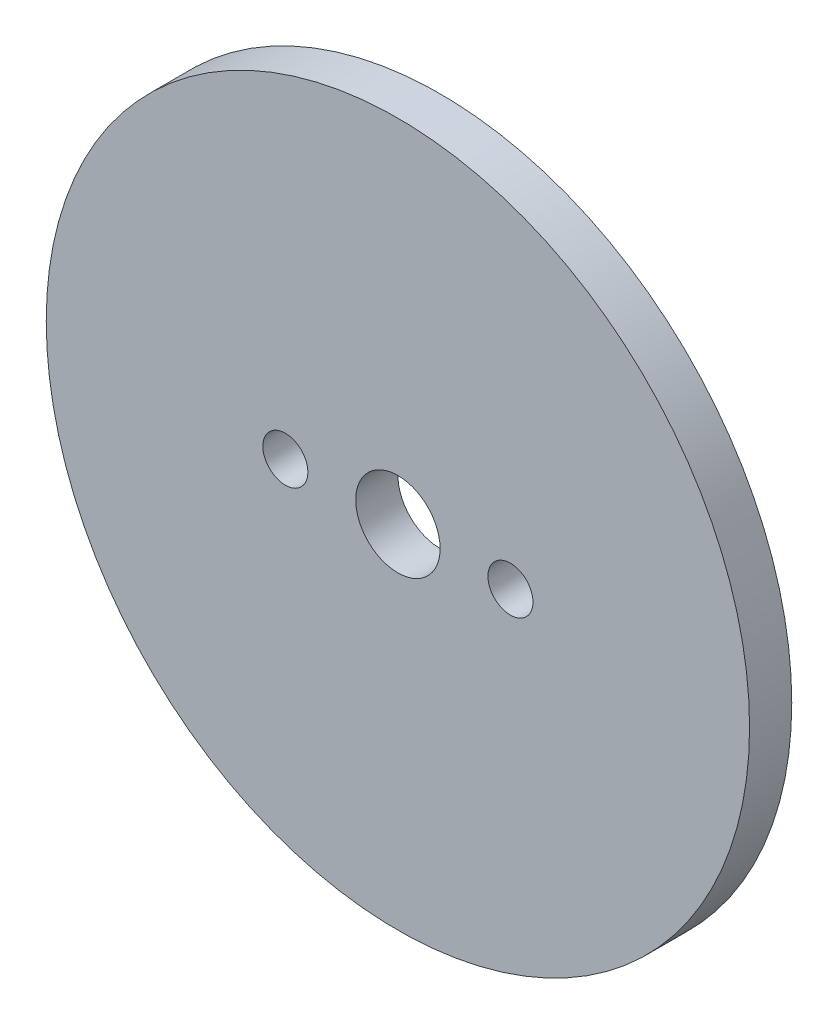
ISO-10303-21;
HEADER;
FILE_DESCRIPTION(('STEP AP214'),'2;1');
FILE_NAME('part.step','',(''),(''),'','','');
FILE_SCHEMA(('AUTOMOTIVE_DESIGN { 1 0 10303 214 1 1 1 1 }'));
ENDSEC;
DATA;
#1=APPLICATION_CONTEXT('core data for automotive mechanical design processes');
#2=APPLICATION_PROTOCOL_DEFINITION('international standard','automotive_design',2000,#1);
#3=PRODUCT_CONTEXT('',#1,'mechanical');
#4=PRODUCT('Part','Part','',(#3));
#5=PRODUCT_RELATED_PRODUCT_CATEGORY('part','',(#4));
#6=PRODUCT_DEFINITION_FORMATION('','',#4);
#7=PRODUCT_DEFINITION_CONTEXT('part definition',#1,'design');
#8=PRODUCT_DEFINITION('design','',#6,#7);
#9=PRODUCT_DEFINITION_SHAPE('','',#8);
#10=(LENGTH_UNIT() NAMED_UNIT(*) SI_UNIT(.MILLI.,.METRE.));
#11=(NAMED_UNIT(*) PLANE_ANGLE_UNIT() SI_UNIT($,.RADIAN.));
#12=(NAMED_UNIT(*) SI_UNIT($,.STERADIAN.) SOLID_ANGLE_UNIT());
#13=UNCERTAINTY_MEASURE_WITH_UNIT(LENGTH_MEASURE(1.E-05),#10,'distance_accuracy_value','');
#14=(GEOMETRIC_REPRESENTATION_CONTEXT(3) GLOBAL_UNCERTAINTY_ASSIGNED_CONTEXT((#13)) GLOBAL_UNIT_ASSIGNED_CONTEXT((#10,
#11,#12)) REPRESENTATION_CONTEXT('',''));
#15=CARTESIAN_POINT('',(0.,0.,0.));
#16=DIRECTION('',(0.,0.,1.));
#17=DIRECTION('',(1.,0.,0.));
#18=AXIS2_PLACEMENT_3D('',#15,#16,#17);
#19=CARTESIAN_POINT('',(0.,0.,1.5));
#20=DIRECTION('',(0.,0.,1.));
#21=DIRECTION('',(1.,0.,0.));
#22=AXIS2_PLACEMENT_3D('',#19,#20,#21);
#23=PLANE('',#22);
#24=CARTESIAN_POINT('',(-8.,0.,1.5));
#25=DIRECTION('',(0.,0.,1.));
#26=DIRECTION('',(1.,0.,0.));
#27=AXIS2_PLACEMENT_3D('',#24,#25,#26);
#28=CIRCLE('',#27,1.6);
#29=CARTESIAN_POINT('',(-6.4,0.,1.5));
#30=VERTEX_POINT('',#29);
#31=EDGE_CURVE('E48',#30,#30,#28,.T.);
#32=ORIENTED_EDGE('',*,*,#31,.F.);
#33=EDGE_LOOP('',(#32));
#34=FACE_BOUND('',#33,.T.);
#35=CARTESIAN_POINT('',(0.,0.,1.5));
#36=DIRECTION('',(0.,0.,1.));
#37=DIRECTION('',(1.,0.,0.));
#38=AXIS2_PLACEMENT_3D('',#35,#36,#37);
#39=CIRCLE('',#38,25.);
#40=CARTESIAN_POINT('',(25.,0.,1.5));
#41=VERTEX_POINT('',#40);
#42=EDGE_CURVE('E10',#41,#41,#39,.T.);
#43=ORIENTED_EDGE('',*,*,#42,.T.);
#44=EDGE_LOOP('',(#43));
#45=FACE_BOUND('',#44,.T.);
#46=CARTESIAN_POINT('',(0.,0.,1.5));
#47=DIRECTION('',(0.,0.,1.));
#48=DIRECTION('',(1.,0.,0.));
#49=AXIS2_PLACEMENT_3D('',#46,#47,#48);
#50=CIRCLE('',#49,3.);
#51=CARTESIAN_POINT('',(3.,0.,1.5));
#52=VERTEX_POINT('',#51);
#53=EDGE_CURVE('E43',#52,#52,#50,.T.);
#54=ORIENTED_EDGE('',*,*,#53,.F.);
#55=EDGE_LOOP('',(#54));
#56=FACE_BOUND('',#55,.T.);
#57=CARTESIAN_POINT('',(8.,0.,1.5));
#58=DIRECTION('',(0.,0.,1.));
#59=DIRECTION('',(1.,0.,0.));
#60=AXIS2_PLACEMENT_3D('',#57,#58,#59);
#61=CIRCLE('',#60,1.6);
#62=CARTESIAN_POINT('',(9.6,0.,1.5));
#63=VERTEX_POINT('',#62);
#64=EDGE_CURVE('E54',#63,#63,#61,.T.);
#65=ORIENTED_EDGE('',*,*,#64,.F.);
#66=EDGE_LOOP('',(#65));
#67=FACE_BOUND('',#66,.T.);
#68=ADVANCED_FACE('F32',(#34,#45,#56,#67),#23,.T.);
#69=CARTESIAN_POINT('',(0.,0.,-1.5));
#70=DIRECTION('',(0.,0.,1.));
#71=DIRECTION('',(1.,0.,0.));
#72=AXIS2_PLACEMENT_3D('',#69,#70,#71);
#73=PLANE('',#72);
#74=CARTESIAN_POINT('',(0.,0.,-1.5));
#75=DIRECTION('',(0.,0.,1.));
#76=DIRECTION('',(1.,0.,0.));
#77=AXIS2_PLACEMENT_3D('',#74,#75,#76);
#78=CIRCLE('',#77,25.);
#79=CARTESIAN_POINT('',(25.,0.,-1.5));
#80=VERTEX_POINT('',#79);
#81=EDGE_CURVE('E36',#80,#80,#78,.T.);
#82=ORIENTED_EDGE('',*,*,#81,.F.);
#83=EDGE_LOOP('',(#82));
#84=FACE_BOUND('',#83,.T.);
#85=CARTESIAN_POINT('',(0.,0.,-1.5));
#86=DIRECTION('',(0.,0.,1.));
#87=DIRECTION('',(1.,0.,0.));
#88=AXIS2_PLACEMENT_3D('',#85,#86,#87);
#89=CIRCLE('',#88,3.);
#90=CARTESIAN_POINT('',(3.,0.,-1.5));
#91=VERTEX_POINT('',#90);
#92=EDGE_CURVE('E45',#91,#91,#89,.T.);
#93=ORIENTED_EDGE('',*,*,#92,.T.);
#94=EDGE_LOOP('',(#93));
#95=FACE_BOUND('',#94,.T.);
#96=CARTESIAN_POINT('',(-8.,0.,-1.5));
#97=DIRECTION('',(0.,0.,1.));
#98=DIRECTION('',(1.,0.,0.));
#99=AXIS2_PLACEMENT_3D('',#96,#97,#98);
#100=CIRCLE('',#99,1.6);
#101=CARTESIAN_POINT('',(-6.4,0.,-1.5));
#102=VERTEX_POINT('',#101);
#103=EDGE_CURVE('E51',#102,#102,#100,.T.);
#104=ORIENTED_EDGE('',*,*,#103,.T.);
#105=EDGE_LOOP('',(#104));
#106=FACE_BOUND('',#105,.T.);
#107=CARTESIAN_POINT('',(8.,0.,-1.5));
#108=DIRECTION('',(0.,0.,1.));
#109=DIRECTION('',(1.,0.,0.));
#110=AXIS2_PLACEMENT_3D('',#107,#108,#109);
#111=CIRCLE('',#110,1.6);
#112=CARTESIAN_POINT('',(9.6,0.,-1.5));
#113=VERTEX_POINT('',#112);
#114=EDGE_CURVE('E57',#113,#113,#111,.T.);
#115=ORIENTED_EDGE('',*,*,#114,.T.);
#116=EDGE_LOOP('',(#115));
#117=FACE_BOUND('',#116,.T.);
#118=ADVANCED_FACE('F67',(#84,#95,#106,#117),#73,.F.);
#119=CARTESIAN_POINT('',(0.,0.,1.5));
#120=DIRECTION('',(0.,0.,-1.));
#121=DIRECTION('',(-1.,0.,0.));
#122=AXIS2_PLACEMENT_3D('',#119,#120,#121);
#123=CYLINDRICAL_SURFACE('',#122,25.);
#124=ORIENTED_EDGE('',*,*,#42,.F.);
#125=EDGE_LOOP('',(#124));
#126=FACE_BOUND('',#125,.T.);
#127=ORIENTED_EDGE('',*,*,#81,.T.);
#128=EDGE_LOOP('',(#127));
#129=FACE_BOUND('',#128,.T.);
#130=ADVANCED_FACE('F34',(#126,#129),#123,.T.);
#131=CARTESIAN_POINT('',(0.,0.,1.5));
#132=DIRECTION('',(0.,0.,-1.));
#133=DIRECTION('',(-1.,0.,0.));
#134=AXIS2_PLACEMENT_3D('',#131,#132,#133);
#135=CYLINDRICAL_SURFACE('',#134,3.);
#136=ORIENTED_EDGE('',*,*,#53,.T.);
#137=EDGE_LOOP('',(#136));
#138=FACE_BOUND('',#137,.T.);
#139=ORIENTED_EDGE('',*,*,#92,.F.);
#140=EDGE_LOOP('',(#139));
#141=FACE_BOUND('',#140,.T.);
#142=ADVANCED_FACE('F76',(#138,#141),#135,.F.);
#143=CARTESIAN_POINT('',(-8.,0.,1.5));
#144=DIRECTION('',(0.,0.,-1.));
#145=DIRECTION('',(-1.,0.,0.));
#146=AXIS2_PLACEMENT_3D('',#143,#144,#145);
#147=CYLINDRICAL_SURFACE('',#146,1.6);
#148=ORIENTED_EDGE('',*,*,#31,.T.);
#149=EDGE_LOOP('',(#148));
#150=FACE_BOUND('',#149,.T.);
#151=ORIENTED_EDGE('',*,*,#103,.F.);
#152=EDGE_LOOP('',(#151));
#153=FACE_BOUND('',#152,.T.);
#154=ADVANCED_FACE('F79',(#150,#153),#147,.F.);
#155=CARTESIAN_POINT('',(8.,0.,1.5));
#156=DIRECTION('',(0.,0.,-1.));
#157=DIRECTION('',(-1.,0.,0.));
#158=AXIS2_PLACEMENT_3D('',#155,#156,#157);
#159=CYLINDRICAL_SURFACE('',#158,1.6);
#160=ORIENTED_EDGE('',*,*,#64,.T.);
#161=EDGE_LOOP('',(#160));
#162=FACE_BOUND('',#161,.T.);
#163=ORIENTED_EDGE('',*,*,#114,.F.);
#164=EDGE_LOOP('',(#163));
#165=FACE_BOUND('',#164,.T.);
#166=ADVANCED_FACE('F63',(#162,#165),#159,.F.);
#167=CLOSED_SHELL('',(#68,#118,#130,#142,#154,#166));
#168=MANIFOLD_SOLID_BREP('B2',#167);
#169=ADVANCED_BREP_SHAPE_REPRESENTATION('',(#18,#168),#14);
#170=SHAPE_DEFINITION_REPRESENTATION(#9,#169);
ENDSEC;
END-ISO-10303-21;
